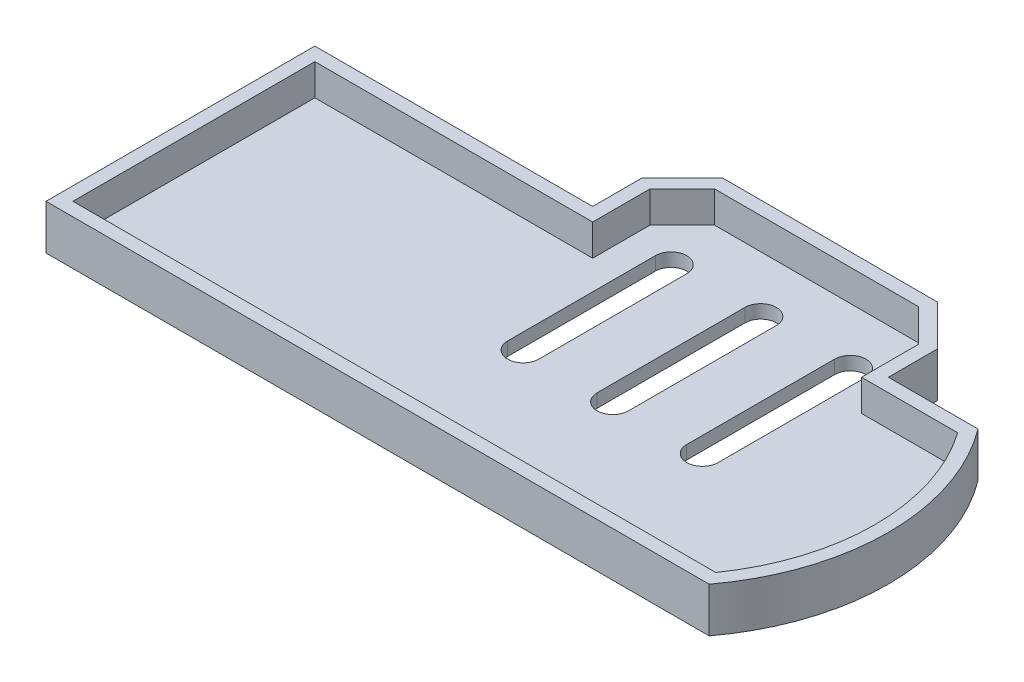
ISO-10303-21;
HEADER;
FILE_DESCRIPTION(('STEP AP214'),'2;1');
FILE_NAME('part.step','',(''),(''),'','','');
FILE_SCHEMA(('AUTOMOTIVE_DESIGN { 1 0 10303 214 1 1 1 1 }'));
ENDSEC;
DATA;
#1=APPLICATION_CONTEXT('core data for automotive mechanical design processes');
#2=APPLICATION_PROTOCOL_DEFINITION('international standard','automotive_design',2000,#1);
#3=PRODUCT_CONTEXT('',#1,'mechanical');
#4=PRODUCT('Part','Part','',(#3));
#5=PRODUCT_RELATED_PRODUCT_CATEGORY('part','',(#4));
#6=PRODUCT_DEFINITION_FORMATION('','',#4);
#7=PRODUCT_DEFINITION_CONTEXT('part definition',#1,'design');
#8=PRODUCT_DEFINITION('design','',#6,#7);
#9=PRODUCT_DEFINITION_SHAPE('','',#8);
#10=(LENGTH_UNIT() NAMED_UNIT(*) SI_UNIT(.MILLI.,.METRE.));
#11=(NAMED_UNIT(*) PLANE_ANGLE_UNIT() SI_UNIT($,.RADIAN.));
#12=(NAMED_UNIT(*) SI_UNIT($,.STERADIAN.) SOLID_ANGLE_UNIT());
#13=UNCERTAINTY_MEASURE_WITH_UNIT(LENGTH_MEASURE(1.E-05),#10,'distance_accuracy_value','');
#14=(GEOMETRIC_REPRESENTATION_CONTEXT(3) GLOBAL_UNCERTAINTY_ASSIGNED_CONTEXT((#13)) GLOBAL_UNIT_ASSIGNED_CONTEXT((#10,
#11,#12)) REPRESENTATION_CONTEXT('',''));
#15=CARTESIAN_POINT('',(0.,0.,0.));
#16=DIRECTION('',(0.,0.,1.));
#17=DIRECTION('',(1.,0.,0.));
#18=AXIS2_PLACEMENT_3D('',#15,#16,#17);
#19=CARTESIAN_POINT('',(95.,10.,-64.5));
#20=DIRECTION('',(0.,-1.,0.));
#21=DIRECTION('',(0.,0.,-1.));
#22=AXIS2_PLACEMENT_3D('',#19,#20,#21);
#23=CYLINDRICAL_SURFACE('',#22,3.5);
#24=DIRECTION('',(0.,-1.,0.));
#25=VECTOR('',#24,1.);
#26=CARTESIAN_POINT('',(98.5,10.,-64.5));
#27=LINE('',#26,#25);
#28=CARTESIAN_POINT('',(98.5,3.,-64.5));
#29=VERTEX_POINT('',#28);
#30=CARTESIAN_POINT('',(98.5,0.,-64.5));
#31=VERTEX_POINT('',#30);
#32=EDGE_CURVE('E411',#29,#31,#27,.T.);
#33=ORIENTED_EDGE('',*,*,#32,.F.);
#34=CARTESIAN_POINT('',(95.,3.,-64.5));
#35=DIRECTION('',(0.,1.,0.));
#36=DIRECTION('',(0.,0.,1.));
#37=AXIS2_PLACEMENT_3D('',#34,#35,#36);
#38=CIRCLE('',#37,3.5);
#39=CARTESIAN_POINT('',(91.5,3.,-64.5));
#40=VERTEX_POINT('',#39);
#41=EDGE_CURVE('E57',#29,#40,#38,.T.);
#42=ORIENTED_EDGE('',*,*,#41,.T.);
#43=DIRECTION('',(0.,-1.,0.));
#44=VECTOR('',#43,1.);
#45=CARTESIAN_POINT('',(91.5,10.,-64.5));
#46=LINE('',#45,#44);
#47=CARTESIAN_POINT('',(91.5,0.,-64.5));
#48=VERTEX_POINT('',#47);
#49=EDGE_CURVE('E417',#40,#48,#46,.T.);
#50=ORIENTED_EDGE('',*,*,#49,.T.);
#51=CARTESIAN_POINT('',(95.,0.,-64.5));
#52=DIRECTION('',(0.,1.,0.));
#53=DIRECTION('',(0.,0.,1.));
#54=AXIS2_PLACEMENT_3D('',#51,#52,#53);
#55=CIRCLE('',#54,3.5);
#56=EDGE_CURVE('E399',#31,#48,#55,.T.);
#57=ORIENTED_EDGE('',*,*,#56,.F.);
#58=EDGE_LOOP('',(#33,#42,#50,#57));
#59=FACE_BOUND('',#58,.T.);
#60=ADVANCED_FACE('F34',(#59),#23,.F.);
#61=CARTESIAN_POINT('',(91.5,10.,-64.5));
#62=DIRECTION('',(1.,0.,0.));
#63=DIRECTION('',(0.,0.,-1.));
#64=AXIS2_PLACEMENT_3D('',#61,#62,#63);
#65=PLANE('',#64);
#66=ORIENTED_EDGE('',*,*,#49,.F.);
#67=DIRECTION('',(0.,0.,1.));
#68=VECTOR('',#67,1.);
#69=CARTESIAN_POINT('',(91.5,3.,-64.5));
#70=LINE('',#69,#68);
#71=CARTESIAN_POINT('',(91.5,3.,-31.5));
#72=VERTEX_POINT('',#71);
#73=EDGE_CURVE('E355',#40,#72,#70,.T.);
#74=ORIENTED_EDGE('',*,*,#73,.T.);
#75=DIRECTION('',(0.,-1.,0.));
#76=VECTOR('',#75,1.);
#77=CARTESIAN_POINT('',(91.5,10.,-31.5));
#78=LINE('',#77,#76);
#79=CARTESIAN_POINT('',(91.5,0.,-31.5));
#80=VERTEX_POINT('',#79);
#81=EDGE_CURVE('E415',#72,#80,#78,.T.);
#82=ORIENTED_EDGE('',*,*,#81,.T.);
#83=DIRECTION('',(0.,0.,1.));
#84=VECTOR('',#83,1.);
#85=CARTESIAN_POINT('',(91.5,0.,-64.5));
#86=LINE('',#85,#84);
#87=EDGE_CURVE('E402',#48,#80,#86,.T.);
#88=ORIENTED_EDGE('',*,*,#87,.F.);
#89=EDGE_LOOP('',(#66,#74,#82,#88));
#90=FACE_BOUND('',#89,.T.);
#91=ADVANCED_FACE('F549',(#90),#65,.T.);
#92=CARTESIAN_POINT('',(95.,10.,-31.5));
#93=DIRECTION('',(0.,-1.,0.));
#94=DIRECTION('',(0.,0.,-1.));
#95=AXIS2_PLACEMENT_3D('',#92,#93,#94);
#96=CYLINDRICAL_SURFACE('',#95,3.5);
#97=ORIENTED_EDGE('',*,*,#81,.F.);
#98=CARTESIAN_POINT('',(95.,3.,-31.5));
#99=DIRECTION('',(0.,1.,0.));
#100=DIRECTION('',(0.,0.,1.));
#101=AXIS2_PLACEMENT_3D('',#98,#99,#100);
#102=CIRCLE('',#101,3.5);
#103=CARTESIAN_POINT('',(98.5,3.,-31.5));
#104=VERTEX_POINT('',#103);
#105=EDGE_CURVE('E352',#72,#104,#102,.T.);
#106=ORIENTED_EDGE('',*,*,#105,.T.);
#107=DIRECTION('',(0.,-1.,0.));
#108=VECTOR('',#107,1.);
#109=CARTESIAN_POINT('',(98.5,10.,-31.5));
#110=LINE('',#109,#108);
#111=CARTESIAN_POINT('',(98.5,0.,-31.5));
#112=VERTEX_POINT('',#111);
#113=EDGE_CURVE('E413',#104,#112,#110,.T.);
#114=ORIENTED_EDGE('',*,*,#113,.T.);
#115=CARTESIAN_POINT('',(95.,0.,-31.5));
#116=DIRECTION('',(0.,1.,0.));
#117=DIRECTION('',(0.,0.,1.));
#118=AXIS2_PLACEMENT_3D('',#115,#116,#117);
#119=CIRCLE('',#118,3.5);
#120=EDGE_CURVE('E405',#80,#112,#119,.T.);
#121=ORIENTED_EDGE('',*,*,#120,.F.);
#122=EDGE_LOOP('',(#97,#106,#114,#121));
#123=FACE_BOUND('',#122,.T.);
#124=ADVANCED_FACE('F555',(#123),#96,.F.);
#125=CARTESIAN_POINT('',(98.5,10.,-64.5));
#126=DIRECTION('',(-1.,0.,0.));
#127=DIRECTION('',(0.,0.,1.));
#128=AXIS2_PLACEMENT_3D('',#125,#126,#127);
#129=PLANE('',#128);
#130=ORIENTED_EDGE('',*,*,#113,.F.);
#131=DIRECTION('',(0.,0.,-1.));
#132=VECTOR('',#131,1.);
#133=CARTESIAN_POINT('',(98.5,3.,-64.5));
#134=LINE('',#133,#132);
#135=EDGE_CURVE('E350',#104,#29,#134,.T.);
#136=ORIENTED_EDGE('',*,*,#135,.T.);
#137=ORIENTED_EDGE('',*,*,#32,.T.);
#138=DIRECTION('',(0.,0.,-1.));
#139=VECTOR('',#138,1.);
#140=CARTESIAN_POINT('',(98.5,0.,-64.5));
#141=LINE('',#140,#139);
#142=EDGE_CURVE('E408',#112,#31,#141,.T.);
#143=ORIENTED_EDGE('',*,*,#142,.F.);
#144=EDGE_LOOP('',(#130,#136,#137,#143));
#145=FACE_BOUND('',#144,.T.);
#146=ADVANCED_FACE('F713',(#145),#129,.T.);
#147=CARTESIAN_POINT('',(75.,10.,-64.5));
#148=DIRECTION('',(0.,-1.,0.));
#149=DIRECTION('',(0.,0.,-1.));
#150=AXIS2_PLACEMENT_3D('',#147,#148,#149);
#151=CYLINDRICAL_SURFACE('',#150,3.5);
#152=DIRECTION('',(0.,-1.,0.));
#153=VECTOR('',#152,1.);
#154=CARTESIAN_POINT('',(78.5,10.,-64.5));
#155=LINE('',#154,#153);
#156=CARTESIAN_POINT('',(78.5,3.,-64.5));
#157=VERTEX_POINT('',#156);
#158=CARTESIAN_POINT('',(78.5,0.,-64.5));
#159=VERTEX_POINT('',#158);
#160=EDGE_CURVE('E391',#157,#159,#155,.T.);
#161=ORIENTED_EDGE('',*,*,#160,.F.);
#162=CARTESIAN_POINT('',(75.,3.,-64.5));
#163=DIRECTION('',(0.,1.,0.));
#164=DIRECTION('',(0.,0.,1.));
#165=AXIS2_PLACEMENT_3D('',#162,#163,#164);
#166=CIRCLE('',#165,3.5);
#167=CARTESIAN_POINT('',(71.5,3.,-64.5));
#168=VERTEX_POINT('',#167);
#169=EDGE_CURVE('E347',#157,#168,#166,.T.);
#170=ORIENTED_EDGE('',*,*,#169,.T.);
#171=DIRECTION('',(0.,-1.,0.));
#172=VECTOR('',#171,1.);
#173=CARTESIAN_POINT('',(71.5,10.,-64.5));
#174=LINE('',#173,#172);
#175=CARTESIAN_POINT('',(71.5,0.,-64.5));
#176=VERTEX_POINT('',#175);
#177=EDGE_CURVE('E397',#168,#176,#174,.T.);
#178=ORIENTED_EDGE('',*,*,#177,.T.);
#179=CARTESIAN_POINT('',(75.,0.,-64.5));
#180=DIRECTION('',(0.,1.,0.));
#181=DIRECTION('',(0.,0.,1.));
#182=AXIS2_PLACEMENT_3D('',#179,#180,#181);
#183=CIRCLE('',#182,3.5);
#184=EDGE_CURVE('E379',#159,#176,#183,.T.);
#185=ORIENTED_EDGE('',*,*,#184,.F.);
#186=EDGE_LOOP('',(#161,#170,#178,#185));
#187=FACE_BOUND('',#186,.T.);
#188=ADVANCED_FACE('F721',(#187),#151,.F.);
#189=CARTESIAN_POINT('',(71.5,10.,-64.5));
#190=DIRECTION('',(1.,0.,0.));
#191=DIRECTION('',(0.,0.,-1.));
#192=AXIS2_PLACEMENT_3D('',#189,#190,#191);
#193=PLANE('',#192);
#194=ORIENTED_EDGE('',*,*,#177,.F.);
#195=DIRECTION('',(0.,0.,1.));
#196=VECTOR('',#195,1.);
#197=CARTESIAN_POINT('',(71.5,3.,-64.5));
#198=LINE('',#197,#196);
#199=CARTESIAN_POINT('',(71.5,3.,-31.5));
#200=VERTEX_POINT('',#199);
#201=EDGE_CURVE('E344',#168,#200,#198,.T.);
#202=ORIENTED_EDGE('',*,*,#201,.T.);
#203=DIRECTION('',(0.,-1.,0.));
#204=VECTOR('',#203,1.);
#205=CARTESIAN_POINT('',(71.5,10.,-31.5));
#206=LINE('',#205,#204);
#207=CARTESIAN_POINT('',(71.5,0.,-31.5));
#208=VERTEX_POINT('',#207);
#209=EDGE_CURVE('E395',#200,#208,#206,.T.);
#210=ORIENTED_EDGE('',*,*,#209,.T.);
#211=DIRECTION('',(0.,0.,1.));
#212=VECTOR('',#211,1.);
#213=CARTESIAN_POINT('',(71.5,0.,-64.5));
#214=LINE('',#213,#212);
#215=EDGE_CURVE('E382',#176,#208,#214,.T.);
#216=ORIENTED_EDGE('',*,*,#215,.F.);
#217=EDGE_LOOP('',(#194,#202,#210,#216));
#218=FACE_BOUND('',#217,.T.);
#219=ADVANCED_FACE('F730',(#218),#193,.T.);
#220=CARTESIAN_POINT('',(75.,10.,-31.5));
#221=DIRECTION('',(0.,-1.,0.));
#222=DIRECTION('',(0.,0.,-1.));
#223=AXIS2_PLACEMENT_3D('',#220,#221,#222);
#224=CYLINDRICAL_SURFACE('',#223,3.50000000000002);
#225=ORIENTED_EDGE('',*,*,#209,.F.);
#226=CARTESIAN_POINT('',(75.,3.,-31.5));
#227=DIRECTION('',(0.,1.,0.));
#228=DIRECTION('',(0.,0.,1.));
#229=AXIS2_PLACEMENT_3D('',#226,#227,#228);
#230=CIRCLE('',#229,3.50000000000002);
#231=CARTESIAN_POINT('',(78.5,3.,-31.5));
#232=VERTEX_POINT('',#231);
#233=EDGE_CURVE('E341',#200,#232,#230,.T.);
#234=ORIENTED_EDGE('',*,*,#233,.T.);
#235=DIRECTION('',(0.,-1.,0.));
#236=VECTOR('',#235,1.);
#237=CARTESIAN_POINT('',(78.5,10.,-31.5));
#238=LINE('',#237,#236);
#239=CARTESIAN_POINT('',(78.5,0.,-31.5));
#240=VERTEX_POINT('',#239);
#241=EDGE_CURVE('E393',#232,#240,#238,.T.);
#242=ORIENTED_EDGE('',*,*,#241,.T.);
#243=CARTESIAN_POINT('',(75.,0.,-31.5));
#244=DIRECTION('',(0.,1.,0.));
#245=DIRECTION('',(0.,0.,1.));
#246=AXIS2_PLACEMENT_3D('',#243,#244,#245);
#247=CIRCLE('',#246,3.50000000000002);
#248=EDGE_CURVE('E385',#208,#240,#247,.T.);
#249=ORIENTED_EDGE('',*,*,#248,.F.);
#250=EDGE_LOOP('',(#225,#234,#242,#249));
#251=FACE_BOUND('',#250,.T.);
#252=ADVANCED_FACE('F739',(#251),#224,.F.);
#253=CARTESIAN_POINT('',(78.5,10.,-64.5));
#254=DIRECTION('',(-1.,0.,0.));
#255=DIRECTION('',(0.,0.,1.));
#256=AXIS2_PLACEMENT_3D('',#253,#254,#255);
#257=PLANE('',#256);
#258=ORIENTED_EDGE('',*,*,#241,.F.);
#259=DIRECTION('',(0.,0.,-1.));
#260=VECTOR('',#259,1.);
#261=CARTESIAN_POINT('',(78.5,3.,-64.5));
#262=LINE('',#261,#260);
#263=EDGE_CURVE('E338',#232,#157,#262,.T.);
#264=ORIENTED_EDGE('',*,*,#263,.T.);
#265=ORIENTED_EDGE('',*,*,#160,.T.);
#266=DIRECTION('',(0.,0.,-1.));
#267=VECTOR('',#266,1.);
#268=CARTESIAN_POINT('',(78.5,0.,-64.5));
#269=LINE('',#268,#267);
#270=EDGE_CURVE('E388',#240,#159,#269,.T.);
#271=ORIENTED_EDGE('',*,*,#270,.F.);
#272=EDGE_LOOP('',(#258,#264,#265,#271));
#273=FACE_BOUND('',#272,.T.);
#274=ADVANCED_FACE('F748',(#273),#257,.T.);
#275=CARTESIAN_POINT('',(115.,10.,-64.5));
#276=DIRECTION('',(0.,-1.,0.));
#277=DIRECTION('',(0.,0.,-1.));
#278=AXIS2_PLACEMENT_3D('',#275,#276,#277);
#279=CYLINDRICAL_SURFACE('',#278,3.5);
#280=DIRECTION('',(0.,-1.,0.));
#281=VECTOR('',#280,1.);
#282=CARTESIAN_POINT('',(118.5,10.,-64.5));
#283=LINE('',#282,#281);
#284=CARTESIAN_POINT('',(118.5,3.,-64.5));
#285=VERTEX_POINT('',#284);
#286=CARTESIAN_POINT('',(118.5,0.,-64.5));
#287=VERTEX_POINT('',#286);
#288=EDGE_CURVE('E371',#285,#287,#283,.T.);
#289=ORIENTED_EDGE('',*,*,#288,.F.);
#290=CARTESIAN_POINT('',(115.,3.,-64.5));
#291=DIRECTION('',(0.,1.,0.));
#292=DIRECTION('',(0.,0.,1.));
#293=AXIS2_PLACEMENT_3D('',#290,#291,#292);
#294=CIRCLE('',#293,3.5);
#295=CARTESIAN_POINT('',(111.5,3.,-64.5));
#296=VERTEX_POINT('',#295);
#297=EDGE_CURVE('E335',#285,#296,#294,.T.);
#298=ORIENTED_EDGE('',*,*,#297,.T.);
#299=DIRECTION('',(0.,-1.,0.));
#300=VECTOR('',#299,1.);
#301=CARTESIAN_POINT('',(111.5,10.,-64.5));
#302=LINE('',#301,#300);
#303=CARTESIAN_POINT('',(111.5,0.,-64.5));
#304=VERTEX_POINT('',#303);
#305=EDGE_CURVE('E377',#296,#304,#302,.T.);
#306=ORIENTED_EDGE('',*,*,#305,.T.);
#307=CARTESIAN_POINT('',(115.,0.,-64.5));
#308=DIRECTION('',(0.,1.,0.));
#309=DIRECTION('',(0.,0.,-1.));
#310=AXIS2_PLACEMENT_3D('',#307,#308,#309);
#311=CIRCLE('',#310,3.5);
#312=EDGE_CURVE('E359',#287,#304,#311,.T.);
#313=ORIENTED_EDGE('',*,*,#312,.F.);
#314=EDGE_LOOP('',(#289,#298,#306,#313));
#315=FACE_BOUND('',#314,.T.);
#316=ADVANCED_FACE('F757',(#315),#279,.F.);
#317=CARTESIAN_POINT('',(111.5,10.,-64.5));
#318=DIRECTION('',(1.,0.,0.));
#319=DIRECTION('',(0.,0.,-1.));
#320=AXIS2_PLACEMENT_3D('',#317,#318,#319);
#321=PLANE('',#320);
#322=ORIENTED_EDGE('',*,*,#305,.F.);
#323=DIRECTION('',(0.,0.,1.));
#324=VECTOR('',#323,1.);
#325=CARTESIAN_POINT('',(111.5,3.,-64.5));
#326=LINE('',#325,#324);
#327=CARTESIAN_POINT('',(111.5,3.,-31.5));
#328=VERTEX_POINT('',#327);
#329=EDGE_CURVE('E332',#296,#328,#326,.T.);
#330=ORIENTED_EDGE('',*,*,#329,.T.);
#331=DIRECTION('',(0.,-1.,0.));
#332=VECTOR('',#331,1.);
#333=CARTESIAN_POINT('',(111.5,10.,-31.5));
#334=LINE('',#333,#332);
#335=CARTESIAN_POINT('',(111.5,0.,-31.5));
#336=VERTEX_POINT('',#335);
#337=EDGE_CURVE('E375',#328,#336,#334,.T.);
#338=ORIENTED_EDGE('',*,*,#337,.T.);
#339=DIRECTION('',(0.,0.,1.));
#340=VECTOR('',#339,1.);
#341=CARTESIAN_POINT('',(111.5,0.,-64.5));
#342=LINE('',#341,#340);
#343=EDGE_CURVE('E362',#304,#336,#342,.T.);
#344=ORIENTED_EDGE('',*,*,#343,.F.);
#345=EDGE_LOOP('',(#322,#330,#338,#344));
#346=FACE_BOUND('',#345,.T.);
#347=ADVANCED_FACE('F766',(#346),#321,.T.);
#348=CARTESIAN_POINT('',(115.,10.,-31.5));
#349=DIRECTION('',(0.,-1.,0.));
#350=DIRECTION('',(0.,0.,-1.));
#351=AXIS2_PLACEMENT_3D('',#348,#349,#350);
#352=CYLINDRICAL_SURFACE('',#351,3.50000000000002);
#353=ORIENTED_EDGE('',*,*,#337,.F.);
#354=CARTESIAN_POINT('',(115.,3.,-31.5));
#355=DIRECTION('',(0.,1.,0.));
#356=DIRECTION('',(0.,0.,1.));
#357=AXIS2_PLACEMENT_3D('',#354,#355,#356);
#358=CIRCLE('',#357,3.50000000000002);
#359=CARTESIAN_POINT('',(118.5,3.,-31.5));
#360=VERTEX_POINT('',#359);
#361=EDGE_CURVE('E314',#328,#360,#358,.T.);
#362=ORIENTED_EDGE('',*,*,#361,.T.);
#363=DIRECTION('',(0.,-1.,0.));
#364=VECTOR('',#363,1.);
#365=CARTESIAN_POINT('',(118.5,10.,-31.5));
#366=LINE('',#365,#364);
#367=CARTESIAN_POINT('',(118.5,0.,-31.5));
#368=VERTEX_POINT('',#367);
#369=EDGE_CURVE('E373',#360,#368,#366,.T.);
#370=ORIENTED_EDGE('',*,*,#369,.T.);
#371=CARTESIAN_POINT('',(115.,0.,-31.5));
#372=DIRECTION('',(0.,1.,0.));
#373=DIRECTION('',(0.,0.,-1.));
#374=AXIS2_PLACEMENT_3D('',#371,#372,#373);
#375=CIRCLE('',#374,3.50000000000002);
#376=EDGE_CURVE('E365',#336,#368,#375,.T.);
#377=ORIENTED_EDGE('',*,*,#376,.F.);
#378=EDGE_LOOP('',(#353,#362,#370,#377));
#379=FACE_BOUND('',#378,.T.);
#380=ADVANCED_FACE('F775',(#379),#352,.F.);
#381=CARTESIAN_POINT('',(118.5,10.,-64.5));
#382=DIRECTION('',(-1.,0.,0.));
#383=DIRECTION('',(0.,0.,1.));
#384=AXIS2_PLACEMENT_3D('',#381,#382,#383);
#385=PLANE('',#384);
#386=ORIENTED_EDGE('',*,*,#369,.F.);
#387=DIRECTION('',(0.,0.,-1.));
#388=VECTOR('',#387,1.);
#389=CARTESIAN_POINT('',(118.5,3.,-64.5));
#390=LINE('',#389,#388);
#391=EDGE_CURVE('E11',#360,#285,#390,.T.);
#392=ORIENTED_EDGE('',*,*,#391,.T.);
#393=ORIENTED_EDGE('',*,*,#288,.T.);
#394=DIRECTION('',(0.,0.,-1.));
#395=VECTOR('',#394,1.);
#396=CARTESIAN_POINT('',(118.5,0.,-64.5));
#397=LINE('',#396,#395);
#398=EDGE_CURVE('E368',#368,#287,#397,.T.);
#399=ORIENTED_EDGE('',*,*,#398,.F.);
#400=EDGE_LOOP('',(#386,#392,#393,#399));
#401=FACE_BOUND('',#400,.T.);
#402=ADVANCED_FACE('F563',(#401),#385,.T.);
#403=CARTESIAN_POINT('',(108.,10.,-30.));
#404=DIRECTION('',(0.,1.,0.));
#405=DIRECTION('',(0.,0.,1.));
#406=AXIS2_PLACEMENT_3D('',#403,#404,#405);
#407=PLANE('',#406);
#408=DIRECTION('',(1.,0.,0.));
#409=VECTOR('',#408,1.);
#410=CARTESIAN_POINT('',(3.,10.,-3.));
#411=LINE('',#410,#409);
#412=CARTESIAN_POINT('',(3.,10.,-3.));
#413=VERTEX_POINT('',#412);
#414=CARTESIAN_POINT('',(146.470768123343,10.,-3.));
#415=VERTEX_POINT('',#414);
#416=EDGE_CURVE('E49',#413,#415,#411,.T.);
#417=ORIENTED_EDGE('',*,*,#416,.F.);
#418=DIRECTION('',(0.,0.,1.));
#419=VECTOR('',#418,1.);
#420=CARTESIAN_POINT('',(3.,10.,-57.));
#421=LINE('',#420,#419);
#422=CARTESIAN_POINT('',(3.,10.,-57.));
#423=VERTEX_POINT('',#422);
#424=EDGE_CURVE('E264',#423,#413,#421,.T.);
#425=ORIENTED_EDGE('',*,*,#424,.F.);
#426=DIRECTION('',(-1.,0.,0.));
#427=VECTOR('',#426,1.);
#428=CARTESIAN_POINT('',(65.,10.,-57.));
#429=LINE('',#428,#427);
#430=CARTESIAN_POINT('',(65.,10.,-57.));
#431=VERTEX_POINT('',#430);
#432=EDGE_CURVE('E267',#431,#423,#429,.T.);
#433=ORIENTED_EDGE('',*,*,#432,.F.);
#434=DIRECTION('',(0.,0.,1.));
#435=VECTOR('',#434,1.);
#436=CARTESIAN_POINT('',(65.,10.,-69.7573593128807));
#437=LINE('',#436,#435);
#438=CARTESIAN_POINT('',(65.,10.,-69.7573593128807));
#439=VERTEX_POINT('',#438);
#440=EDGE_CURVE('E307',#439,#431,#437,.T.);
#441=ORIENTED_EDGE('',*,*,#440,.F.);
#442=DIRECTION('',(-0.707106781186545,0.,0.70710678118655));
#443=VECTOR('',#442,1.);
#444=CARTESIAN_POINT('',(72.2426406871192,10.,-77.));
#445=LINE('',#444,#443);
#446=CARTESIAN_POINT('',(72.2426406871192,10.,-77.));
#447=VERTEX_POINT('',#446);
#448=EDGE_CURVE('E304',#447,#439,#445,.T.);
#449=ORIENTED_EDGE('',*,*,#448,.F.);
#450=DIRECTION('',(-1.,0.,0.));
#451=VECTOR('',#450,1.);
#452=CARTESIAN_POINT('',(117.757359312881,10.,-77.));
#453=LINE('',#452,#451);
#454=CARTESIAN_POINT('',(117.757359312881,10.,-77.));
#455=VERTEX_POINT('',#454);
#456=EDGE_CURVE('E301',#455,#447,#453,.T.);
#457=ORIENTED_EDGE('',*,*,#456,.F.);
#458=DIRECTION('',(-0.707106781186545,0.,-0.70710678118655));
#459=VECTOR('',#458,1.);
#460=CARTESIAN_POINT('',(125.,10.,-69.7573593128807));
#461=LINE('',#460,#459);
#462=CARTESIAN_POINT('',(125.,10.,-69.7573593128807));
#463=VERTEX_POINT('',#462);
#464=EDGE_CURVE('E298',#463,#455,#461,.T.);
#465=ORIENTED_EDGE('',*,*,#464,.F.);
#466=DIRECTION('',(0.,0.,-1.));
#467=VECTOR('',#466,1.);
#468=CARTESIAN_POINT('',(125.,10.,-57.));
#469=LINE('',#468,#467);
#470=CARTESIAN_POINT('',(125.,10.,-57.));
#471=VERTEX_POINT('',#470);
#472=EDGE_CURVE('E295',#471,#463,#469,.T.);
#473=ORIENTED_EDGE('',*,*,#472,.F.);
#474=DIRECTION('',(-1.,0.,0.));
#475=VECTOR('',#474,1.);
#476=CARTESIAN_POINT('',(146.470768123343,10.,-57.));
#477=LINE('',#476,#475);
#478=CARTESIAN_POINT('',(146.470768123343,10.,-57.));
#479=VERTEX_POINT('',#478);
#480=EDGE_CURVE('E292',#479,#471,#477,.T.);
#481=ORIENTED_EDGE('',*,*,#480,.F.);
#482=CARTESIAN_POINT('',(108.,10.,-30.));
#483=DIRECTION('',(0.,1.,0.));
#484=DIRECTION('',(0.,0.,1.));
#485=AXIS2_PLACEMENT_3D('',#482,#483,#484);
#486=CIRCLE('',#485,47.);
#487=EDGE_CURVE('E290',#415,#479,#486,.T.);
#488=ORIENTED_EDGE('',*,*,#487,.F.);
#489=EDGE_LOOP('',(#417,#425,#433,#441,#449,#457,#465,#473,#481,#488));
#490=FACE_BOUND('',#489,.T.);
#491=DIRECTION('',(1.,0.,0.));
#492=VECTOR('',#491,1.);
#493=CARTESIAN_POINT('',(0.,10.,0.));
#494=LINE('',#493,#492);
#495=CARTESIAN_POINT('',(0.,10.,0.));
#496=VERTEX_POINT('',#495);
#497=CARTESIAN_POINT('',(148.,10.,0.));
#498=VERTEX_POINT('',#497);
#499=EDGE_CURVE('E420',#496,#498,#494,.T.);
#500=ORIENTED_EDGE('',*,*,#499,.T.);
#501=CARTESIAN_POINT('',(108.,10.,-30.));
#502=DIRECTION('',(0.,1.,0.));
#503=DIRECTION('',(0.,0.,1.));
#504=AXIS2_PLACEMENT_3D('',#501,#502,#503);
#505=CIRCLE('',#504,50.);
#506=CARTESIAN_POINT('',(148.,10.,-60.));
#507=VERTEX_POINT('',#506);
#508=EDGE_CURVE('E423',#498,#507,#505,.T.);
#509=ORIENTED_EDGE('',*,*,#508,.T.);
#510=DIRECTION('',(-1.,0.,0.));
#511=VECTOR('',#510,1.);
#512=CARTESIAN_POINT('',(128.,10.,-60.));
#513=LINE('',#512,#511);
#514=CARTESIAN_POINT('',(128.,10.,-60.));
#515=VERTEX_POINT('',#514);
#516=EDGE_CURVE('E426',#507,#515,#513,.T.);
#517=ORIENTED_EDGE('',*,*,#516,.T.);
#518=DIRECTION('',(0.,0.,-1.));
#519=VECTOR('',#518,1.);
#520=CARTESIAN_POINT('',(128.,10.,-60.));
#521=LINE('',#520,#519);
#522=CARTESIAN_POINT('',(128.,10.,-71.));
#523=VERTEX_POINT('',#522);
#524=EDGE_CURVE('E428',#515,#523,#521,.T.);
#525=ORIENTED_EDGE('',*,*,#524,.T.);
#526=DIRECTION('',(-0.707106781186546,0.,-0.707106781186549));
#527=VECTOR('',#526,1.);
#528=CARTESIAN_POINT('',(128.,10.,-71.));
#529=LINE('',#528,#527);
#530=CARTESIAN_POINT('',(119.,10.,-80.));
#531=VERTEX_POINT('',#530);
#532=EDGE_CURVE('E430',#523,#531,#529,.T.);
#533=ORIENTED_EDGE('',*,*,#532,.T.);
#534=DIRECTION('',(-1.,0.,0.));
#535=VECTOR('',#534,1.);
#536=CARTESIAN_POINT('',(119.,10.,-80.));
#537=LINE('',#536,#535);
#538=CARTESIAN_POINT('',(71.,10.,-80.));
#539=VERTEX_POINT('',#538);
#540=EDGE_CURVE('E432',#531,#539,#537,.T.);
#541=ORIENTED_EDGE('',*,*,#540,.T.);
#542=DIRECTION('',(-0.707106781186545,0.,0.70710678118655));
#543=VECTOR('',#542,1.);
#544=CARTESIAN_POINT('',(62.,10.,-71.));
#545=LINE('',#544,#543);
#546=CARTESIAN_POINT('',(62.,10.,-71.));
#547=VERTEX_POINT('',#546);
#548=EDGE_CURVE('E434',#539,#547,#545,.T.);
#549=ORIENTED_EDGE('',*,*,#548,.T.);
#550=DIRECTION('',(0.,0.,1.));
#551=VECTOR('',#550,1.);
#552=CARTESIAN_POINT('',(62.,10.,-60.));
#553=LINE('',#552,#551);
#554=CARTESIAN_POINT('',(62.,10.,-60.));
#555=VERTEX_POINT('',#554);
#556=EDGE_CURVE('E436',#547,#555,#553,.T.);
#557=ORIENTED_EDGE('',*,*,#556,.T.);
#558=DIRECTION('',(-1.,0.,0.));
#559=VECTOR('',#558,1.);
#560=CARTESIAN_POINT('',(0.,10.,-60.));
#561=LINE('',#560,#559);
#562=CARTESIAN_POINT('',(0.,10.,-60.));
#563=VERTEX_POINT('',#562);
#564=EDGE_CURVE('E438',#555,#563,#561,.T.);
#565=ORIENTED_EDGE('',*,*,#564,.T.);
#566=DIRECTION('',(0.,0.,1.));
#567=VECTOR('',#566,1.);
#568=CARTESIAN_POINT('',(0.,10.,0.));
#569=LINE('',#568,#567);
#570=EDGE_CURVE('E440',#563,#496,#569,.T.);
#571=ORIENTED_EDGE('',*,*,#570,.T.);
#572=EDGE_LOOP('',(#500,#509,#517,#525,#533,#541,#549,#557,#565,#571));
#573=FACE_BOUND('',#572,.T.);
#574=ADVANCED_FACE('F514',(#490,#573),#407,.T.);
#575=CARTESIAN_POINT('',(108.,0.,-30.));
#576=DIRECTION('',(0.,1.,0.));
#577=DIRECTION('',(0.,0.,1.));
#578=AXIS2_PLACEMENT_3D('',#575,#576,#577);
#579=PLANE('',#578);
#580=ORIENTED_EDGE('',*,*,#184,.T.);
#581=ORIENTED_EDGE('',*,*,#215,.T.);
#582=ORIENTED_EDGE('',*,*,#248,.T.);
#583=ORIENTED_EDGE('',*,*,#270,.T.);
#584=EDGE_LOOP('',(#580,#581,#582,#583));
#585=FACE_BOUND('',#584,.T.);
#586=DIRECTION('',(1.,0.,0.));
#587=VECTOR('',#586,1.);
#588=CARTESIAN_POINT('',(0.,0.,0.));
#589=LINE('',#588,#587);
#590=CARTESIAN_POINT('',(0.,0.,0.));
#591=VERTEX_POINT('',#590);
#592=CARTESIAN_POINT('',(148.,0.,0.));
#593=VERTEX_POINT('',#592);
#594=EDGE_CURVE('E419',#591,#593,#589,.T.);
#595=ORIENTED_EDGE('',*,*,#594,.F.);
#596=DIRECTION('',(0.,0.,1.));
#597=VECTOR('',#596,1.);
#598=CARTESIAN_POINT('',(0.,0.,0.));
#599=LINE('',#598,#597);
#600=CARTESIAN_POINT('',(0.,0.,-60.));
#601=VERTEX_POINT('',#600);
#602=EDGE_CURVE('E424',#601,#591,#599,.T.);
#603=ORIENTED_EDGE('',*,*,#602,.F.);
#604=DIRECTION('',(-1.,0.,0.));
#605=VECTOR('',#604,1.);
#606=CARTESIAN_POINT('',(0.,0.,-60.));
#607=LINE('',#606,#605);
#608=CARTESIAN_POINT('',(62.,0.,-60.));
#609=VERTEX_POINT('',#608);
#610=EDGE_CURVE('E459',#609,#601,#607,.T.);
#611=ORIENTED_EDGE('',*,*,#610,.F.);
#612=DIRECTION('',(0.,0.,1.));
#613=VECTOR('',#612,1.);
#614=CARTESIAN_POINT('',(62.,0.,-60.));
#615=LINE('',#614,#613);
#616=CARTESIAN_POINT('',(62.,0.,-71.));
#617=VERTEX_POINT('',#616);
#618=EDGE_CURVE('E457',#617,#609,#615,.T.);
#619=ORIENTED_EDGE('',*,*,#618,.F.);
#620=DIRECTION('',(-0.707106781186545,0.,0.70710678118655));
#621=VECTOR('',#620,1.);
#622=CARTESIAN_POINT('',(62.,0.,-71.));
#623=LINE('',#622,#621);
#624=CARTESIAN_POINT('',(71.,0.,-80.));
#625=VERTEX_POINT('',#624);
#626=EDGE_CURVE('E455',#625,#617,#623,.T.);
#627=ORIENTED_EDGE('',*,*,#626,.F.);
#628=DIRECTION('',(-1.,0.,0.));
#629=VECTOR('',#628,1.);
#630=CARTESIAN_POINT('',(119.,0.,-80.));
#631=LINE('',#630,#629);
#632=CARTESIAN_POINT('',(119.,0.,-80.));
#633=VERTEX_POINT('',#632);
#634=EDGE_CURVE('E453',#633,#625,#631,.T.);
#635=ORIENTED_EDGE('',*,*,#634,.F.);
#636=DIRECTION('',(-0.707106781186546,0.,-0.707106781186549));
#637=VECTOR('',#636,1.);
#638=CARTESIAN_POINT('',(128.,0.,-71.));
#639=LINE('',#638,#637);
#640=CARTESIAN_POINT('',(128.,0.,-71.));
#641=VERTEX_POINT('',#640);
#642=EDGE_CURVE('E451',#641,#633,#639,.T.);
#643=ORIENTED_EDGE('',*,*,#642,.F.);
#644=DIRECTION('',(0.,0.,-1.));
#645=VECTOR('',#644,1.);
#646=CARTESIAN_POINT('',(128.,0.,-60.));
#647=LINE('',#646,#645);
#648=CARTESIAN_POINT('',(128.,0.,-60.));
#649=VERTEX_POINT('',#648);
#650=EDGE_CURVE('E449',#649,#641,#647,.T.);
#651=ORIENTED_EDGE('',*,*,#650,.F.);
#652=DIRECTION('',(-1.,0.,0.));
#653=VECTOR('',#652,1.);
#654=CARTESIAN_POINT('',(128.,0.,-60.));
#655=LINE('',#654,#653);
#656=CARTESIAN_POINT('',(148.,0.,-60.));
#657=VERTEX_POINT('',#656);
#658=EDGE_CURVE('E447',#657,#649,#655,.T.);
#659=ORIENTED_EDGE('',*,*,#658,.F.);
#660=CARTESIAN_POINT('',(108.,0.,-30.));
#661=DIRECTION('',(0.,1.,0.));
#662=DIRECTION('',(0.,0.,1.));
#663=AXIS2_PLACEMENT_3D('',#660,#661,#662);
#664=CIRCLE('',#663,50.);
#665=EDGE_CURVE('E445',#593,#657,#664,.T.);
#666=ORIENTED_EDGE('',*,*,#665,.F.);
#667=EDGE_LOOP('',(#595,#603,#611,#619,#627,#635,#643,#651,#659,#666));
#668=FACE_BOUND('',#667,.T.);
#669=ORIENTED_EDGE('',*,*,#56,.T.);
#670=ORIENTED_EDGE('',*,*,#87,.T.);
#671=ORIENTED_EDGE('',*,*,#120,.T.);
#672=ORIENTED_EDGE('',*,*,#142,.T.);
#673=EDGE_LOOP('',(#669,#670,#671,#672));
#674=FACE_BOUND('',#673,.T.);
#675=ORIENTED_EDGE('',*,*,#312,.T.);
#676=ORIENTED_EDGE('',*,*,#343,.T.);
#677=ORIENTED_EDGE('',*,*,#376,.T.);
#678=ORIENTED_EDGE('',*,*,#398,.T.);
#679=EDGE_LOOP('',(#675,#676,#677,#678));
#680=FACE_BOUND('',#679,.T.);
#681=ADVANCED_FACE('F498',(#585,#668,#674,#680),#579,.F.);
#682=CARTESIAN_POINT('',(0.,10.,0.));
#683=DIRECTION('',(0.,0.,-1.));
#684=DIRECTION('',(-1.,0.,0.));
#685=AXIS2_PLACEMENT_3D('',#682,#683,#684);
#686=PLANE('',#685);
#687=ORIENTED_EDGE('',*,*,#594,.T.);
#688=DIRECTION('',(0.,-1.,0.));
#689=VECTOR('',#688,1.);
#690=CARTESIAN_POINT('',(148.,10.,0.));
#691=LINE('',#690,#689);
#692=EDGE_CURVE('E42',#498,#593,#691,.T.);
#693=ORIENTED_EDGE('',*,*,#692,.F.);
#694=ORIENTED_EDGE('',*,*,#499,.F.);
#695=DIRECTION('',(0.,-1.,0.));
#696=VECTOR('',#695,1.);
#697=CARTESIAN_POINT('',(0.,10.,0.));
#698=LINE('',#697,#696);
#699=EDGE_CURVE('E442',#496,#591,#698,.T.);
#700=ORIENTED_EDGE('',*,*,#699,.T.);
#701=EDGE_LOOP('',(#687,#693,#694,#700));
#702=FACE_BOUND('',#701,.T.);
#703=ADVANCED_FACE('F36',(#702),#686,.F.);
#704=CARTESIAN_POINT('',(108.,10.,-30.));
#705=DIRECTION('',(0.,-1.,0.));
#706=DIRECTION('',(0.,0.,-1.));
#707=AXIS2_PLACEMENT_3D('',#704,#705,#706);
#708=CYLINDRICAL_SURFACE('',#707,50.);
#709=ORIENTED_EDGE('',*,*,#665,.T.);
#710=DIRECTION('',(0.,-1.,0.));
#711=VECTOR('',#710,1.);
#712=CARTESIAN_POINT('',(148.,10.,-60.));
#713=LINE('',#712,#711);
#714=EDGE_CURVE('E485',#507,#657,#713,.T.);
#715=ORIENTED_EDGE('',*,*,#714,.F.);
#716=ORIENTED_EDGE('',*,*,#508,.F.);
#717=ORIENTED_EDGE('',*,*,#692,.T.);
#718=EDGE_LOOP('',(#709,#715,#716,#717));
#719=FACE_BOUND('',#718,.T.);
#720=ADVANCED_FACE('F490',(#719),#708,.T.);
#721=CARTESIAN_POINT('',(128.,10.,-60.));
#722=DIRECTION('',(0.,0.,1.));
#723=DIRECTION('',(1.,0.,0.));
#724=AXIS2_PLACEMENT_3D('',#721,#722,#723);
#725=PLANE('',#724);
#726=ORIENTED_EDGE('',*,*,#658,.T.);
#727=DIRECTION('',(0.,-1.,0.));
#728=VECTOR('',#727,1.);
#729=CARTESIAN_POINT('',(128.,10.,-60.));
#730=LINE('',#729,#728);
#731=EDGE_CURVE('E482',#515,#649,#730,.T.);
#732=ORIENTED_EDGE('',*,*,#731,.F.);
#733=ORIENTED_EDGE('',*,*,#516,.F.);
#734=ORIENTED_EDGE('',*,*,#714,.T.);
#735=EDGE_LOOP('',(#726,#732,#733,#734));
#736=FACE_BOUND('',#735,.T.);
#737=ADVANCED_FACE('F506',(#736),#725,.F.);
#738=CARTESIAN_POINT('',(128.,10.,-60.));
#739=DIRECTION('',(-1.,0.,0.));
#740=DIRECTION('',(0.,0.,1.));
#741=AXIS2_PLACEMENT_3D('',#738,#739,#740);
#742=PLANE('',#741);
#743=ORIENTED_EDGE('',*,*,#650,.T.);
#744=DIRECTION('',(0.,-1.,0.));
#745=VECTOR('',#744,1.);
#746=CARTESIAN_POINT('',(128.,10.,-71.));
#747=LINE('',#746,#745);
#748=EDGE_CURVE('E479',#523,#641,#747,.T.);
#749=ORIENTED_EDGE('',*,*,#748,.F.);
#750=ORIENTED_EDGE('',*,*,#524,.F.);
#751=ORIENTED_EDGE('',*,*,#731,.T.);
#752=EDGE_LOOP('',(#743,#749,#750,#751));
#753=FACE_BOUND('',#752,.T.);
#754=ADVANCED_FACE('F510',(#753),#742,.F.);
#755=CARTESIAN_POINT('',(128.,10.,-71.));
#756=DIRECTION('',(-0.707106781186549,0.,0.707106781186546));
#757=DIRECTION('',(0.707106781186546,0.,0.707106781186549));
#758=AXIS2_PLACEMENT_3D('',#755,#756,#757);
#759=PLANE('',#758);
#760=ORIENTED_EDGE('',*,*,#642,.T.);
#761=DIRECTION('',(0.,-1.,0.));
#762=VECTOR('',#761,1.);
#763=CARTESIAN_POINT('',(119.,10.,-80.));
#764=LINE('',#763,#762);
#765=EDGE_CURVE('E476',#531,#633,#764,.T.);
#766=ORIENTED_EDGE('',*,*,#765,.F.);
#767=ORIENTED_EDGE('',*,*,#532,.F.);
#768=ORIENTED_EDGE('',*,*,#748,.T.);
#769=EDGE_LOOP('',(#760,#766,#767,#768));
#770=FACE_BOUND('',#769,.T.);
#771=ADVANCED_FACE('F539',(#770),#759,.F.);
#772=CARTESIAN_POINT('',(119.,10.,-80.));
#773=DIRECTION('',(0.,0.,1.));
#774=DIRECTION('',(1.,0.,0.));
#775=AXIS2_PLACEMENT_3D('',#772,#773,#774);
#776=PLANE('',#775);
#777=ORIENTED_EDGE('',*,*,#634,.T.);
#778=DIRECTION('',(0.,-1.,0.));
#779=VECTOR('',#778,1.);
#780=CARTESIAN_POINT('',(71.,10.,-80.));
#781=LINE('',#780,#779);
#782=EDGE_CURVE('E473',#539,#625,#781,.T.);
#783=ORIENTED_EDGE('',*,*,#782,.F.);
#784=ORIENTED_EDGE('',*,*,#540,.F.);
#785=ORIENTED_EDGE('',*,*,#765,.T.);
#786=EDGE_LOOP('',(#777,#783,#784,#785));
#787=FACE_BOUND('',#786,.T.);
#788=ADVANCED_FACE('F537',(#787),#776,.F.);
#789=CARTESIAN_POINT('',(62.,10.,-71.));
#790=DIRECTION('',(0.70710678118655,0.,0.707106781186545));
#791=DIRECTION('',(0.707106781186545,0.,-0.70710678118655));
#792=AXIS2_PLACEMENT_3D('',#789,#790,#791);
#793=PLANE('',#792);
#794=ORIENTED_EDGE('',*,*,#626,.T.);
#795=DIRECTION('',(0.,-1.,0.));
#796=VECTOR('',#795,1.);
#797=CARTESIAN_POINT('',(62.,10.,-71.));
#798=LINE('',#797,#796);
#799=EDGE_CURVE('E470',#547,#617,#798,.T.);
#800=ORIENTED_EDGE('',*,*,#799,.F.);
#801=ORIENTED_EDGE('',*,*,#548,.F.);
#802=ORIENTED_EDGE('',*,*,#782,.T.);
#803=EDGE_LOOP('',(#794,#800,#801,#802));
#804=FACE_BOUND('',#803,.T.);
#805=ADVANCED_FACE('F533',(#804),#793,.F.);
#806=CARTESIAN_POINT('',(62.,10.,-60.));
#807=DIRECTION('',(1.,0.,0.));
#808=DIRECTION('',(0.,0.,-1.));
#809=AXIS2_PLACEMENT_3D('',#806,#807,#808);
#810=PLANE('',#809);
#811=ORIENTED_EDGE('',*,*,#618,.T.);
#812=DIRECTION('',(0.,-1.,0.));
#813=VECTOR('',#812,1.);
#814=CARTESIAN_POINT('',(62.,10.,-60.));
#815=LINE('',#814,#813);
#816=EDGE_CURVE('E467',#555,#609,#815,.T.);
#817=ORIENTED_EDGE('',*,*,#816,.F.);
#818=ORIENTED_EDGE('',*,*,#556,.F.);
#819=ORIENTED_EDGE('',*,*,#799,.T.);
#820=EDGE_LOOP('',(#811,#817,#818,#819));
#821=FACE_BOUND('',#820,.T.);
#822=ADVANCED_FACE('F528',(#821),#810,.F.);
#823=CARTESIAN_POINT('',(0.,10.,-60.));
#824=DIRECTION('',(0.,0.,1.));
#825=DIRECTION('',(1.,0.,0.));
#826=AXIS2_PLACEMENT_3D('',#823,#824,#825);
#827=PLANE('',#826);
#828=ORIENTED_EDGE('',*,*,#610,.T.);
#829=DIRECTION('',(0.,-1.,0.));
#830=VECTOR('',#829,1.);
#831=CARTESIAN_POINT('',(0.,10.,-60.));
#832=LINE('',#831,#830);
#833=EDGE_CURVE('E464',#563,#601,#832,.T.);
#834=ORIENTED_EDGE('',*,*,#833,.F.);
#835=ORIENTED_EDGE('',*,*,#564,.F.);
#836=ORIENTED_EDGE('',*,*,#816,.T.);
#837=EDGE_LOOP('',(#828,#834,#835,#836));
#838=FACE_BOUND('',#837,.T.);
#839=ADVANCED_FACE('F522',(#838),#827,.F.);
#840=CARTESIAN_POINT('',(0.,10.,0.));
#841=DIRECTION('',(1.,0.,0.));
#842=DIRECTION('',(0.,0.,-1.));
#843=AXIS2_PLACEMENT_3D('',#840,#841,#842);
#844=PLANE('',#843);
#845=ORIENTED_EDGE('',*,*,#602,.T.);
#846=ORIENTED_EDGE('',*,*,#699,.F.);
#847=ORIENTED_EDGE('',*,*,#570,.F.);
#848=ORIENTED_EDGE('',*,*,#833,.T.);
#849=EDGE_LOOP('',(#845,#846,#847,#848));
#850=FACE_BOUND('',#849,.T.);
#851=ADVANCED_FACE('F520',(#850),#844,.F.);
#852=CARTESIAN_POINT('',(3.,3.,-3.));
#853=DIRECTION('',(0.,0.,1.));
#854=DIRECTION('',(1.,0.,0.));
#855=AXIS2_PLACEMENT_3D('',#852,#853,#854);
#856=PLANE('',#855);
#857=ORIENTED_EDGE('',*,*,#416,.T.);
#858=DIRECTION('',(0.,1.,0.));
#859=VECTOR('',#858,1.);
#860=CARTESIAN_POINT('',(146.470768123343,3.,-3.));
#861=LINE('',#860,#859);
#862=CARTESIAN_POINT('',(146.470768123343,3.,-3.));
#863=VERTEX_POINT('',#862);
#864=EDGE_CURVE('E241',#863,#415,#861,.T.);
#865=ORIENTED_EDGE('',*,*,#864,.F.);
#866=DIRECTION('',(1.,0.,0.));
#867=VECTOR('',#866,1.);
#868=CARTESIAN_POINT('',(3.,3.,-3.));
#869=LINE('',#868,#867);
#870=CARTESIAN_POINT('',(3.,3.,-3.));
#871=VERTEX_POINT('',#870);
#872=EDGE_CURVE('E245',#871,#863,#869,.T.);
#873=ORIENTED_EDGE('',*,*,#872,.F.);
#874=DIRECTION('',(0.,1.,0.));
#875=VECTOR('',#874,1.);
#876=CARTESIAN_POINT('',(3.,3.,-3.));
#877=LINE('',#876,#875);
#878=EDGE_CURVE('E312',#871,#413,#877,.T.);
#879=ORIENTED_EDGE('',*,*,#878,.T.);
#880=EDGE_LOOP('',(#857,#865,#873,#879));
#881=FACE_BOUND('',#880,.T.);
#882=ADVANCED_FACE('F243',(#881),#856,.F.);
#883=CARTESIAN_POINT('',(3.,3.,-57.));
#884=DIRECTION('',(-1.,0.,0.));
#885=DIRECTION('',(0.,0.,1.));
#886=AXIS2_PLACEMENT_3D('',#883,#884,#885);
#887=PLANE('',#886);
#888=ORIENTED_EDGE('',*,*,#424,.T.);
#889=ORIENTED_EDGE('',*,*,#878,.F.);
#890=DIRECTION('',(0.,0.,1.));
#891=VECTOR('',#890,1.);
#892=CARTESIAN_POINT('',(3.,3.,-57.));
#893=LINE('',#892,#891);
#894=CARTESIAN_POINT('',(3.,3.,-57.));
#895=VERTEX_POINT('',#894);
#896=EDGE_CURVE('E251',#895,#871,#893,.T.);
#897=ORIENTED_EDGE('',*,*,#896,.F.);
#898=DIRECTION('',(0.,1.,0.));
#899=VECTOR('',#898,1.);
#900=CARTESIAN_POINT('',(3.,3.,-57.));
#901=LINE('',#900,#899);
#902=EDGE_CURVE('E315',#895,#423,#901,.T.);
#903=ORIENTED_EDGE('',*,*,#902,.T.);
#904=EDGE_LOOP('',(#888,#889,#897,#903));
#905=FACE_BOUND('',#904,.T.);
#906=ADVANCED_FACE('F597',(#905),#887,.F.);
#907=CARTESIAN_POINT('',(65.,3.,-57.));
#908=DIRECTION('',(0.,0.,-1.));
#909=DIRECTION('',(-1.,0.,0.));
#910=AXIS2_PLACEMENT_3D('',#907,#908,#909);
#911=PLANE('',#910);
#912=ORIENTED_EDGE('',*,*,#432,.T.);
#913=ORIENTED_EDGE('',*,*,#902,.F.);
#914=DIRECTION('',(-1.,0.,0.));
#915=VECTOR('',#914,1.);
#916=CARTESIAN_POINT('',(65.,3.,-57.));
#917=LINE('',#916,#915);
#918=CARTESIAN_POINT('',(65.,3.,-57.));
#919=VERTEX_POINT('',#918);
#920=EDGE_CURVE('E286',#919,#895,#917,.T.);
#921=ORIENTED_EDGE('',*,*,#920,.F.);
#922=DIRECTION('',(0.,1.,0.));
#923=VECTOR('',#922,1.);
#924=CARTESIAN_POINT('',(65.,3.,-57.));
#925=LINE('',#924,#923);
#926=EDGE_CURVE('E317',#919,#431,#925,.T.);
#927=ORIENTED_EDGE('',*,*,#926,.T.);
#928=EDGE_LOOP('',(#912,#913,#921,#927));
#929=FACE_BOUND('',#928,.T.);
#930=ADVANCED_FACE('F605',(#929),#911,.F.);
#931=CARTESIAN_POINT('',(65.,3.,-69.7573593128807));
#932=DIRECTION('',(-1.,0.,0.));
#933=DIRECTION('',(0.,0.,1.));
#934=AXIS2_PLACEMENT_3D('',#931,#932,#933);
#935=PLANE('',#934);
#936=ORIENTED_EDGE('',*,*,#440,.T.);
#937=ORIENTED_EDGE('',*,*,#926,.F.);
#938=DIRECTION('',(0.,0.,1.));
#939=VECTOR('',#938,1.);
#940=CARTESIAN_POINT('',(65.,3.,-69.7573593128807));
#941=LINE('',#940,#939);
#942=CARTESIAN_POINT('',(65.,3.,-69.7573593128807));
#943=VERTEX_POINT('',#942);
#944=EDGE_CURVE('E283',#943,#919,#941,.T.);
#945=ORIENTED_EDGE('',*,*,#944,.F.);
#946=DIRECTION('',(0.,1.,0.));
#947=VECTOR('',#946,1.);
#948=CARTESIAN_POINT('',(65.,3.,-69.7573593128807));
#949=LINE('',#948,#947);
#950=EDGE_CURVE('E319',#943,#439,#949,.T.);
#951=ORIENTED_EDGE('',*,*,#950,.T.);
#952=EDGE_LOOP('',(#936,#937,#945,#951));
#953=FACE_BOUND('',#952,.T.);
#954=ADVANCED_FACE('F613',(#953),#935,.F.);
#955=CARTESIAN_POINT('',(72.2426406871192,3.,-77.));
#956=DIRECTION('',(-0.70710678118655,0.,-0.707106781186545));
#957=DIRECTION('',(-0.707106781186545,0.,0.70710678118655));
#958=AXIS2_PLACEMENT_3D('',#955,#956,#957);
#959=PLANE('',#958);
#960=ORIENTED_EDGE('',*,*,#448,.T.);
#961=ORIENTED_EDGE('',*,*,#950,.F.);
#962=DIRECTION('',(-0.707106781186545,0.,0.70710678118655));
#963=VECTOR('',#962,1.);
#964=CARTESIAN_POINT('',(72.2426406871192,3.,-77.));
#965=LINE('',#964,#963);
#966=CARTESIAN_POINT('',(72.2426406871192,3.,-77.));
#967=VERTEX_POINT('',#966);
#968=EDGE_CURVE('E280',#967,#943,#965,.T.);
#969=ORIENTED_EDGE('',*,*,#968,.F.);
#970=DIRECTION('',(0.,1.,0.));
#971=VECTOR('',#970,1.);
#972=CARTESIAN_POINT('',(72.2426406871192,3.,-77.));
#973=LINE('',#972,#971);
#974=EDGE_CURVE('E321',#967,#447,#973,.T.);
#975=ORIENTED_EDGE('',*,*,#974,.T.);
#976=EDGE_LOOP('',(#960,#961,#969,#975));
#977=FACE_BOUND('',#976,.T.);
#978=ADVANCED_FACE('F621',(#977),#959,.F.);
#979=CARTESIAN_POINT('',(117.757359312881,3.,-77.));
#980=DIRECTION('',(0.,0.,-1.));
#981=DIRECTION('',(-1.,0.,0.));
#982=AXIS2_PLACEMENT_3D('',#979,#980,#981);
#983=PLANE('',#982);
#984=ORIENTED_EDGE('',*,*,#456,.T.);
#985=ORIENTED_EDGE('',*,*,#974,.F.);
#986=DIRECTION('',(-1.,0.,0.));
#987=VECTOR('',#986,1.);
#988=CARTESIAN_POINT('',(117.757359312881,3.,-77.));
#989=LINE('',#988,#987);
#990=CARTESIAN_POINT('',(117.757359312881,3.,-77.));
#991=VERTEX_POINT('',#990);
#992=EDGE_CURVE('E277',#991,#967,#989,.T.);
#993=ORIENTED_EDGE('',*,*,#992,.F.);
#994=DIRECTION('',(0.,1.,0.));
#995=VECTOR('',#994,1.);
#996=CARTESIAN_POINT('',(117.757359312881,3.,-77.));
#997=LINE('',#996,#995);
#998=EDGE_CURVE('E323',#991,#455,#997,.T.);
#999=ORIENTED_EDGE('',*,*,#998,.T.);
#1000=EDGE_LOOP('',(#984,#985,#993,#999));
#1001=FACE_BOUND('',#1000,.T.);
#1002=ADVANCED_FACE('F629',(#1001),#983,.F.);
#1003=CARTESIAN_POINT('',(125.,3.,-69.7573593128807));
#1004=DIRECTION('',(0.70710678118655,0.,-0.707106781186546));
#1005=DIRECTION('',(-0.707106781186546,0.,-0.70710678118655));
#1006=AXIS2_PLACEMENT_3D('',#1003,#1004,#1005);
#1007=PLANE('',#1006);
#1008=ORIENTED_EDGE('',*,*,#464,.T.);
#1009=ORIENTED_EDGE('',*,*,#998,.F.);
#1010=DIRECTION('',(-0.707106781186545,0.,-0.70710678118655));
#1011=VECTOR('',#1010,1.);
#1012=CARTESIAN_POINT('',(125.,3.,-69.7573593128807));
#1013=LINE('',#1012,#1011);
#1014=CARTESIAN_POINT('',(125.,3.,-69.7573593128807));
#1015=VERTEX_POINT('',#1014);
#1016=EDGE_CURVE('E274',#1015,#991,#1013,.T.);
#1017=ORIENTED_EDGE('',*,*,#1016,.F.);
#1018=DIRECTION('',(0.,1.,0.));
#1019=VECTOR('',#1018,1.);
#1020=CARTESIAN_POINT('',(125.,3.,-69.7573593128807));
#1021=LINE('',#1020,#1019);
#1022=EDGE_CURVE('E325',#1015,#463,#1021,.T.);
#1023=ORIENTED_EDGE('',*,*,#1022,.T.);
#1024=EDGE_LOOP('',(#1008,#1009,#1017,#1023));
#1025=FACE_BOUND('',#1024,.T.);
#1026=ADVANCED_FACE('F637',(#1025),#1007,.F.);
#1027=CARTESIAN_POINT('',(125.,3.,-57.));
#1028=DIRECTION('',(1.,0.,0.));
#1029=DIRECTION('',(0.,0.,-1.));
#1030=AXIS2_PLACEMENT_3D('',#1027,#1028,#1029);
#1031=PLANE('',#1030);
#1032=ORIENTED_EDGE('',*,*,#472,.T.);
#1033=ORIENTED_EDGE('',*,*,#1022,.F.);
#1034=DIRECTION('',(0.,0.,-1.));
#1035=VECTOR('',#1034,1.);
#1036=CARTESIAN_POINT('',(125.,3.,-57.));
#1037=LINE('',#1036,#1035);
#1038=CARTESIAN_POINT('',(125.,3.,-57.));
#1039=VERTEX_POINT('',#1038);
#1040=EDGE_CURVE('E271',#1039,#1015,#1037,.T.);
#1041=ORIENTED_EDGE('',*,*,#1040,.F.);
#1042=DIRECTION('',(0.,1.,0.));
#1043=VECTOR('',#1042,1.);
#1044=CARTESIAN_POINT('',(125.,3.,-57.));
#1045=LINE('',#1044,#1043);
#1046=EDGE_CURVE('E327',#1039,#471,#1045,.T.);
#1047=ORIENTED_EDGE('',*,*,#1046,.T.);
#1048=EDGE_LOOP('',(#1032,#1033,#1041,#1047));
#1049=FACE_BOUND('',#1048,.T.);
#1050=ADVANCED_FACE('F645',(#1049),#1031,.F.);
#1051=CARTESIAN_POINT('',(146.470768123343,3.,-57.));
#1052=DIRECTION('',(0.,0.,-1.));
#1053=DIRECTION('',(-1.,0.,0.));
#1054=AXIS2_PLACEMENT_3D('',#1051,#1052,#1053);
#1055=PLANE('',#1054);
#1056=ORIENTED_EDGE('',*,*,#480,.T.);
#1057=ORIENTED_EDGE('',*,*,#1046,.F.);
#1058=DIRECTION('',(-1.,0.,0.));
#1059=VECTOR('',#1058,1.);
#1060=CARTESIAN_POINT('',(146.470768123343,3.,-57.));
#1061=LINE('',#1060,#1059);
#1062=CARTESIAN_POINT('',(146.470768123343,3.,-57.));
#1063=VERTEX_POINT('',#1062);
#1064=EDGE_CURVE('E259',#1063,#1039,#1061,.T.);
#1065=ORIENTED_EDGE('',*,*,#1064,.F.);
#1066=DIRECTION('',(0.,1.,0.));
#1067=VECTOR('',#1066,1.);
#1068=CARTESIAN_POINT('',(146.470768123343,3.,-57.));
#1069=LINE('',#1068,#1067);
#1070=EDGE_CURVE('E250',#1063,#479,#1069,.T.);
#1071=ORIENTED_EDGE('',*,*,#1070,.T.);
#1072=EDGE_LOOP('',(#1056,#1057,#1065,#1071));
#1073=FACE_BOUND('',#1072,.T.);
#1074=ADVANCED_FACE('F653',(#1073),#1055,.F.);
#1075=CARTESIAN_POINT('',(108.,3.,-30.));
#1076=DIRECTION('',(0.,1.,0.));
#1077=DIRECTION('',(0.,0.,1.));
#1078=AXIS2_PLACEMENT_3D('',#1075,#1076,#1077);
#1079=CYLINDRICAL_SURFACE('',#1078,47.);
#1080=ORIENTED_EDGE('',*,*,#487,.T.);
#1081=ORIENTED_EDGE('',*,*,#1070,.F.);
#1082=CARTESIAN_POINT('',(108.,3.,-30.));
#1083=DIRECTION('',(0.,1.,0.));
#1084=DIRECTION('',(0.,0.,1.));
#1085=AXIS2_PLACEMENT_3D('',#1082,#1083,#1084);
#1086=CIRCLE('',#1085,47.);
#1087=EDGE_CURVE('E254',#863,#1063,#1086,.T.);
#1088=ORIENTED_EDGE('',*,*,#1087,.F.);
#1089=ORIENTED_EDGE('',*,*,#864,.T.);
#1090=EDGE_LOOP('',(#1080,#1081,#1088,#1089));
#1091=FACE_BOUND('',#1090,.T.);
#1092=ADVANCED_FACE('F255',(#1091),#1079,.F.);
#1093=CARTESIAN_POINT('',(108.,3.,-30.));
#1094=DIRECTION('',(0.,1.,0.));
#1095=DIRECTION('',(0.,0.,1.));
#1096=AXIS2_PLACEMENT_3D('',#1093,#1094,#1095);
#1097=PLANE('',#1096);
#1098=ORIENTED_EDGE('',*,*,#135,.F.);
#1099=ORIENTED_EDGE('',*,*,#105,.F.);
#1100=ORIENTED_EDGE('',*,*,#73,.F.);
#1101=ORIENTED_EDGE('',*,*,#41,.F.);
#1102=EDGE_LOOP('',(#1098,#1099,#1100,#1101));
#1103=FACE_BOUND('',#1102,.T.);
#1104=ORIENTED_EDGE('',*,*,#263,.F.);
#1105=ORIENTED_EDGE('',*,*,#233,.F.);
#1106=ORIENTED_EDGE('',*,*,#201,.F.);
#1107=ORIENTED_EDGE('',*,*,#169,.F.);
#1108=EDGE_LOOP('',(#1104,#1105,#1106,#1107));
#1109=FACE_BOUND('',#1108,.T.);
#1110=ORIENTED_EDGE('',*,*,#391,.F.);
#1111=ORIENTED_EDGE('',*,*,#361,.F.);
#1112=ORIENTED_EDGE('',*,*,#329,.F.);
#1113=ORIENTED_EDGE('',*,*,#297,.F.);
#1114=EDGE_LOOP('',(#1110,#1111,#1112,#1113));
#1115=FACE_BOUND('',#1114,.T.);
#1116=ORIENTED_EDGE('',*,*,#872,.T.);
#1117=ORIENTED_EDGE('',*,*,#1087,.T.);
#1118=ORIENTED_EDGE('',*,*,#1064,.T.);
#1119=ORIENTED_EDGE('',*,*,#1040,.T.);
#1120=ORIENTED_EDGE('',*,*,#1016,.T.);
#1121=ORIENTED_EDGE('',*,*,#992,.T.);
#1122=ORIENTED_EDGE('',*,*,#968,.T.);
#1123=ORIENTED_EDGE('',*,*,#944,.T.);
#1124=ORIENTED_EDGE('',*,*,#920,.T.);
#1125=ORIENTED_EDGE('',*,*,#896,.T.);
#1126=EDGE_LOOP('',(#1116,#1117,#1118,#1119,#1120,#1121,#1122,#1123,#1124,#1125));
#1127=FACE_BOUND('',#1126,.T.);
#1128=ADVANCED_FACE('F261',(#1103,#1109,#1115,#1127),#1097,.T.);
#1129=CLOSED_SHELL('',(#60,#91,#124,#146,#188,#219,#252,#274,#316,#347,#380,#402,#574,#681,#703,
#720,#737,#754,#771,#788,#805,#822,#839,#851,#882,#906,#930,#954,#978,#1002,#1026,#1050,#1074,
#1092,#1128));
#1130=MANIFOLD_SOLID_BREP('B2',#1129);
#1131=ADVANCED_BREP_SHAPE_REPRESENTATION('',(#18,#1130),#14);
#1132=SHAPE_DEFINITION_REPRESENTATION(#9,#1131);
ENDSEC;
END-ISO-10303-21;
